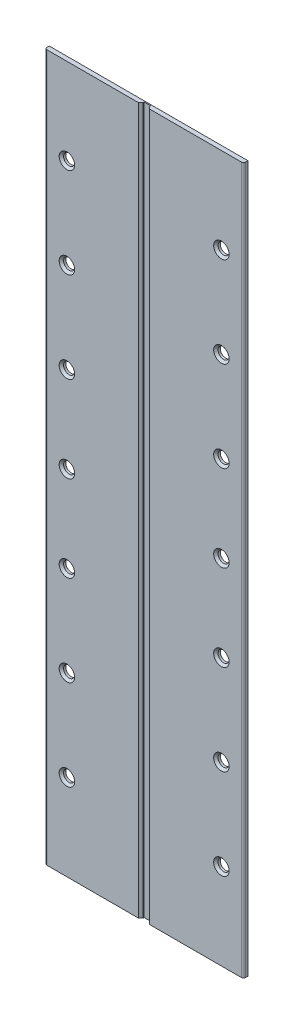
ISO-10303-21;
HEADER;
FILE_DESCRIPTION(('STEP AP214'),'2;1');
FILE_NAME('part.step','',(''),(''),'','','');
FILE_SCHEMA(('AUTOMOTIVE_DESIGN { 1 0 10303 214 1 1 1 1 }'));
ENDSEC;
DATA;
#1=APPLICATION_CONTEXT('core data for automotive mechanical design processes');
#2=APPLICATION_PROTOCOL_DEFINITION('international standard','automotive_design',2000,#1);
#3=PRODUCT_CONTEXT('',#1,'mechanical');
#4=PRODUCT('Part','Part','',(#3));
#5=PRODUCT_RELATED_PRODUCT_CATEGORY('part','',(#4));
#6=PRODUCT_DEFINITION_FORMATION('','',#4);
#7=PRODUCT_DEFINITION_CONTEXT('part definition',#1,'design');
#8=PRODUCT_DEFINITION('design','',#6,#7);
#9=PRODUCT_DEFINITION_SHAPE('','',#8);
#10=(LENGTH_UNIT() NAMED_UNIT(*) SI_UNIT(.MILLI.,.METRE.));
#11=(NAMED_UNIT(*) PLANE_ANGLE_UNIT() SI_UNIT($,.RADIAN.));
#12=(NAMED_UNIT(*) SI_UNIT($,.STERADIAN.) SOLID_ANGLE_UNIT());
#13=UNCERTAINTY_MEASURE_WITH_UNIT(LENGTH_MEASURE(1.E-05),#10,'distance_accuracy_value','');
#14=(GEOMETRIC_REPRESENTATION_CONTEXT(3) GLOBAL_UNCERTAINTY_ASSIGNED_CONTEXT((#13)) GLOBAL_UNIT_ASSIGNED_CONTEXT((#10,
#11,#12)) REPRESENTATION_CONTEXT('',''));
#15=CARTESIAN_POINT('',(0.,0.,0.));
#16=DIRECTION('',(0.,0.,1.));
#17=DIRECTION('',(1.,0.,0.));
#18=AXIS2_PLACEMENT_3D('',#15,#16,#17);
#19=CARTESIAN_POINT('',(0.,0.,2.));
#20=DIRECTION('',(0.,0.,-1.));
#21=DIRECTION('',(-1.,0.,0.));
#22=AXIS2_PLACEMENT_3D('',#19,#20,#21);
#23=PLANE('',#22);
#24=CARTESIAN_POINT('',(-35.,-120.982014682888,2.));
#25=DIRECTION('',(0.,0.,-1.));
#26=DIRECTION('',(-1.,0.,0.));
#27=AXIS2_PLACEMENT_3D('',#24,#25,#26);
#28=CIRCLE('',#27,3.49999999999998);
#29=CARTESIAN_POINT('',(-38.4999999999999,-120.982014682888,2.));
#30=VERTEX_POINT('',#29);
#31=EDGE_CURVE('E251',#30,#30,#28,.T.);
#32=ORIENTED_EDGE('',*,*,#31,.T.);
#33=EDGE_LOOP('',(#32));
#34=FACE_BOUND('',#33,.T.);
#35=CARTESIAN_POINT('',(-35.,-80.,2.));
#36=DIRECTION('',(0.,0.,-1.));
#37=DIRECTION('',(-1.,0.,0.));
#38=AXIS2_PLACEMENT_3D('',#35,#36,#37);
#39=CIRCLE('',#38,3.49999999999998);
#40=CARTESIAN_POINT('',(-38.4999999999999,-80.,2.));
#41=VERTEX_POINT('',#40);
#42=EDGE_CURVE('E254',#41,#41,#39,.T.);
#43=ORIENTED_EDGE('',*,*,#42,.T.);
#44=EDGE_LOOP('',(#43));
#45=FACE_BOUND('',#44,.T.);
#46=CARTESIAN_POINT('',(-35.,-39.0179853171119,2.));
#47=DIRECTION('',(0.,0.,-1.));
#48=DIRECTION('',(-1.,0.,0.));
#49=AXIS2_PLACEMENT_3D('',#46,#47,#48);
#50=CIRCLE('',#49,3.49999999999998);
#51=CARTESIAN_POINT('',(-38.4999999999999,-39.0179853171119,2.));
#52=VERTEX_POINT('',#51);
#53=EDGE_CURVE('E257',#52,#52,#50,.T.);
#54=ORIENTED_EDGE('',*,*,#53,.T.);
#55=EDGE_LOOP('',(#54));
#56=FACE_BOUND('',#55,.T.);
#57=CARTESIAN_POINT('',(-35.,0.,2.));
#58=DIRECTION('',(0.,0.,-1.));
#59=DIRECTION('',(-1.,0.,0.));
#60=AXIS2_PLACEMENT_3D('',#57,#58,#59);
#61=CIRCLE('',#60,3.49999999999998);
#62=CARTESIAN_POINT('',(-38.4999999999999,0.,2.));
#63=VERTEX_POINT('',#62);
#64=EDGE_CURVE('E260',#63,#63,#61,.T.);
#65=ORIENTED_EDGE('',*,*,#64,.T.);
#66=EDGE_LOOP('',(#65));
#67=FACE_BOUND('',#66,.T.);
#68=CARTESIAN_POINT('',(-34.9999999999999,39.0179853171119,2.));
#69=DIRECTION('',(0.,0.,-1.));
#70=DIRECTION('',(-1.,0.,0.));
#71=AXIS2_PLACEMENT_3D('',#68,#69,#70);
#72=CIRCLE('',#71,3.49999999999998);
#73=CARTESIAN_POINT('',(-38.4999999999999,39.0179853171119,2.));
#74=VERTEX_POINT('',#73);
#75=EDGE_CURVE('E263',#74,#74,#72,.T.);
#76=ORIENTED_EDGE('',*,*,#75,.T.);
#77=EDGE_LOOP('',(#76));
#78=FACE_BOUND('',#77,.T.);
#79=CARTESIAN_POINT('',(-35.,80.,2.));
#80=DIRECTION('',(0.,0.,-1.));
#81=DIRECTION('',(-1.,0.,0.));
#82=AXIS2_PLACEMENT_3D('',#79,#80,#81);
#83=CIRCLE('',#82,3.49999999999998);
#84=CARTESIAN_POINT('',(-38.4999999999999,80.,2.));
#85=VERTEX_POINT('',#84);
#86=EDGE_CURVE('E266',#85,#85,#83,.T.);
#87=ORIENTED_EDGE('',*,*,#86,.T.);
#88=EDGE_LOOP('',(#87));
#89=FACE_BOUND('',#88,.T.);
#90=CARTESIAN_POINT('',(-34.9999999999999,120.982014682888,2.));
#91=DIRECTION('',(0.,0.,-1.));
#92=DIRECTION('',(-1.,0.,0.));
#93=AXIS2_PLACEMENT_3D('',#90,#91,#92);
#94=CIRCLE('',#93,3.49999999999998);
#95=CARTESIAN_POINT('',(-38.4999999999999,120.982014682888,2.));
#96=VERTEX_POINT('',#95);
#97=EDGE_CURVE('E269',#96,#96,#94,.T.);
#98=ORIENTED_EDGE('',*,*,#97,.T.);
#99=EDGE_LOOP('',(#98));
#100=FACE_BOUND('',#99,.T.);
#101=DIRECTION('',(1.,0.,0.));
#102=VECTOR('',#101,1.);
#103=CARTESIAN_POINT('',(45.,-160.,2.));
#104=LINE('',#103,#102);
#105=CARTESIAN_POINT('',(-43.9999999999999,-160.,2.));
#106=VERTEX_POINT('',#105);
#107=CARTESIAN_POINT('',(-2.49999999999999,-160.,2.));
#108=VERTEX_POINT('',#107);
#109=EDGE_CURVE('E163',#106,#108,#104,.T.);
#110=ORIENTED_EDGE('',*,*,#109,.T.);
#111=DIRECTION('',(0.,1.,0.));
#112=VECTOR('',#111,1.);
#113=CARTESIAN_POINT('',(-2.5,0.,2.));
#114=LINE('',#113,#112);
#115=CARTESIAN_POINT('',(-2.49999999999999,160.,2.));
#116=VERTEX_POINT('',#115);
#117=EDGE_CURVE('E11',#108,#116,#114,.T.);
#118=ORIENTED_EDGE('',*,*,#117,.T.);
#119=DIRECTION('',(-1.,0.,0.));
#120=VECTOR('',#119,1.);
#121=CARTESIAN_POINT('',(45.,160.,2.));
#122=LINE('',#121,#120);
#123=CARTESIAN_POINT('',(-44.,160.,2.));
#124=VERTEX_POINT('',#123);
#125=EDGE_CURVE('E165',#116,#124,#122,.T.);
#126=ORIENTED_EDGE('',*,*,#125,.T.);
#127=DIRECTION('',(0.,-1.,0.));
#128=VECTOR('',#127,1.);
#129=CARTESIAN_POINT('',(-44.,0.,2.));
#130=LINE('',#129,#128);
#131=EDGE_CURVE('E234',#124,#106,#130,.T.);
#132=ORIENTED_EDGE('',*,*,#131,.T.);
#133=EDGE_LOOP('',(#110,#118,#126,#132));
#134=FACE_BOUND('',#133,.T.);
#135=ADVANCED_FACE('F42',(#34,#45,#56,#67,#78,#89,#100,#134),#23,.F.);
#136=CARTESIAN_POINT('',(34.9999999999999,120.982014682888,2.));
#137=DIRECTION('',(0.,0.,-1.));
#138=DIRECTION('',(-1.,0.,0.));
#139=AXIS2_PLACEMENT_3D('',#136,#137,#138);
#140=CIRCLE('',#139,3.49999999999998);
#141=CARTESIAN_POINT('',(31.5,120.982014682888,2.));
#142=VERTEX_POINT('',#141);
#143=EDGE_CURVE('E290',#142,#142,#140,.T.);
#144=ORIENTED_EDGE('',*,*,#143,.T.);
#145=EDGE_LOOP('',(#144));
#146=FACE_BOUND('',#145,.T.);
#147=CARTESIAN_POINT('',(35.,80.,2.));
#148=DIRECTION('',(0.,0.,-1.));
#149=DIRECTION('',(-1.,0.,0.));
#150=AXIS2_PLACEMENT_3D('',#147,#148,#149);
#151=CIRCLE('',#150,3.49999999999998);
#152=CARTESIAN_POINT('',(31.5,80.,2.));
#153=VERTEX_POINT('',#152);
#154=EDGE_CURVE('E287',#153,#153,#151,.T.);
#155=ORIENTED_EDGE('',*,*,#154,.T.);
#156=EDGE_LOOP('',(#155));
#157=FACE_BOUND('',#156,.T.);
#158=CARTESIAN_POINT('',(34.9999999999999,39.0179853171119,2.));
#159=DIRECTION('',(0.,0.,-1.));
#160=DIRECTION('',(-1.,0.,0.));
#161=AXIS2_PLACEMENT_3D('',#158,#159,#160);
#162=CIRCLE('',#161,3.49999999999998);
#163=CARTESIAN_POINT('',(31.5,39.0179853171119,2.));
#164=VERTEX_POINT('',#163);
#165=EDGE_CURVE('E284',#164,#164,#162,.T.);
#166=ORIENTED_EDGE('',*,*,#165,.T.);
#167=EDGE_LOOP('',(#166));
#168=FACE_BOUND('',#167,.T.);
#169=CARTESIAN_POINT('',(35.,0.,2.));
#170=DIRECTION('',(0.,0.,-1.));
#171=DIRECTION('',(-1.,0.,0.));
#172=AXIS2_PLACEMENT_3D('',#169,#170,#171);
#173=CIRCLE('',#172,3.49999999999998);
#174=CARTESIAN_POINT('',(31.5,0.,2.));
#175=VERTEX_POINT('',#174);
#176=EDGE_CURVE('E281',#175,#175,#173,.T.);
#177=ORIENTED_EDGE('',*,*,#176,.T.);
#178=EDGE_LOOP('',(#177));
#179=FACE_BOUND('',#178,.T.);
#180=CARTESIAN_POINT('',(35.,-39.0179853171119,2.));
#181=DIRECTION('',(0.,0.,-1.));
#182=DIRECTION('',(-1.,0.,0.));
#183=AXIS2_PLACEMENT_3D('',#180,#181,#182);
#184=CIRCLE('',#183,3.49999999999998);
#185=CARTESIAN_POINT('',(31.5,-39.0179853171119,2.));
#186=VERTEX_POINT('',#185);
#187=EDGE_CURVE('E278',#186,#186,#184,.T.);
#188=ORIENTED_EDGE('',*,*,#187,.T.);
#189=EDGE_LOOP('',(#188));
#190=FACE_BOUND('',#189,.T.);
#191=CARTESIAN_POINT('',(35.,-80.,2.));
#192=DIRECTION('',(0.,0.,-1.));
#193=DIRECTION('',(-1.,0.,0.));
#194=AXIS2_PLACEMENT_3D('',#191,#192,#193);
#195=CIRCLE('',#194,3.49999999999998);
#196=CARTESIAN_POINT('',(31.5,-80.,2.));
#197=VERTEX_POINT('',#196);
#198=EDGE_CURVE('E275',#197,#197,#195,.T.);
#199=ORIENTED_EDGE('',*,*,#198,.T.);
#200=EDGE_LOOP('',(#199));
#201=FACE_BOUND('',#200,.T.);
#202=CARTESIAN_POINT('',(35.,-120.982014682888,2.));
#203=DIRECTION('',(0.,0.,-1.));
#204=DIRECTION('',(-1.,0.,0.));
#205=AXIS2_PLACEMENT_3D('',#202,#203,#204);
#206=CIRCLE('',#205,3.49999999999998);
#207=CARTESIAN_POINT('',(31.5,-120.982014682888,2.));
#208=VERTEX_POINT('',#207);
#209=EDGE_CURVE('E272',#208,#208,#206,.T.);
#210=ORIENTED_EDGE('',*,*,#209,.T.);
#211=EDGE_LOOP('',(#210));
#212=FACE_BOUND('',#211,.T.);
#213=CARTESIAN_POINT('',(44.,160.,2.));
#214=VERTEX_POINT('',#213);
#215=CARTESIAN_POINT('',(2.49999999999978,160.,2.));
#216=VERTEX_POINT('',#215);
#217=EDGE_CURVE('E167',#214,#216,#122,.T.);
#218=ORIENTED_EDGE('',*,*,#217,.T.);
#219=DIRECTION('',(0.,-1.,0.));
#220=VECTOR('',#219,1.);
#221=CARTESIAN_POINT('',(2.49999999999988,0.,2.));
#222=LINE('',#221,#220);
#223=CARTESIAN_POINT('',(2.50000000000002,-160.,2.));
#224=VERTEX_POINT('',#223);
#225=EDGE_CURVE('E342',#216,#224,#222,.T.);
#226=ORIENTED_EDGE('',*,*,#225,.T.);
#227=CARTESIAN_POINT('',(44.,-160.,2.));
#228=VERTEX_POINT('',#227);
#229=EDGE_CURVE('E166',#224,#228,#104,.T.);
#230=ORIENTED_EDGE('',*,*,#229,.T.);
#231=DIRECTION('',(0.,1.,0.));
#232=VECTOR('',#231,1.);
#233=CARTESIAN_POINT('',(44.,0.,2.));
#234=LINE('',#233,#232);
#235=EDGE_CURVE('E191',#228,#214,#234,.T.);
#236=ORIENTED_EDGE('',*,*,#235,.T.);
#237=EDGE_LOOP('',(#218,#226,#230,#236));
#238=FACE_BOUND('',#237,.T.);
#239=ADVANCED_FACE('F358',(#146,#157,#168,#179,#190,#201,#212,#238),#23,.F.);
#240=CARTESIAN_POINT('',(0.,0.,0.));
#241=DIRECTION('',(0.,0.,-1.));
#242=DIRECTION('',(-1.,0.,0.));
#243=AXIS2_PLACEMENT_3D('',#240,#241,#242);
#244=PLANE('',#243);
#245=CARTESIAN_POINT('',(-35.,-39.0179853171119,0.));
#246=DIRECTION('',(0.,0.,-1.));
#247=DIRECTION('',(-1.,0.,0.));
#248=AXIS2_PLACEMENT_3D('',#245,#246,#247);
#249=CIRCLE('',#248,2.5);
#250=CARTESIAN_POINT('',(-37.5,-39.0179853171119,0.));
#251=VERTEX_POINT('',#250);
#252=EDGE_CURVE('E175',#251,#251,#249,.T.);
#253=ORIENTED_EDGE('',*,*,#252,.F.);
#254=EDGE_LOOP('',(#253));
#255=FACE_BOUND('',#254,.T.);
#256=CARTESIAN_POINT('',(-34.9999999999999,39.0179853171119,0.));
#257=DIRECTION('',(0.,0.,-1.));
#258=DIRECTION('',(-1.,0.,0.));
#259=AXIS2_PLACEMENT_3D('',#256,#257,#258);
#260=CIRCLE('',#259,2.5);
#261=CARTESIAN_POINT('',(-37.4999999999999,39.0179853171119,0.));
#262=VERTEX_POINT('',#261);
#263=EDGE_CURVE('E218',#262,#262,#260,.F.);
#264=ORIENTED_EDGE('',*,*,#263,.T.);
#265=EDGE_LOOP('',(#264));
#266=FACE_BOUND('',#265,.T.);
#267=CARTESIAN_POINT('',(-35.,80.,0.));
#268=DIRECTION('',(0.,0.,-1.));
#269=DIRECTION('',(-1.,0.,0.));
#270=AXIS2_PLACEMENT_3D('',#267,#268,#269);
#271=CIRCLE('',#270,2.49999999999998);
#272=CARTESIAN_POINT('',(-37.4999999999999,80.,0.));
#273=VERTEX_POINT('',#272);
#274=EDGE_CURVE('E215',#273,#273,#271,.T.);
#275=ORIENTED_EDGE('',*,*,#274,.F.);
#276=EDGE_LOOP('',(#275));
#277=FACE_BOUND('',#276,.T.);
#278=CARTESIAN_POINT('',(35.,80.,0.));
#279=DIRECTION('',(0.,0.,-1.));
#280=DIRECTION('',(-1.,0.,0.));
#281=AXIS2_PLACEMENT_3D('',#278,#279,#280);
#282=CIRCLE('',#281,2.5);
#283=CARTESIAN_POINT('',(32.5,80.,0.));
#284=VERTEX_POINT('',#283);
#285=EDGE_CURVE('E212',#284,#284,#282,.T.);
#286=ORIENTED_EDGE('',*,*,#285,.F.);
#287=EDGE_LOOP('',(#286));
#288=FACE_BOUND('',#287,.T.);
#289=CARTESIAN_POINT('',(-35.,-120.982014682888,0.));
#290=DIRECTION('',(0.,0.,-1.));
#291=DIRECTION('',(-1.,0.,0.));
#292=AXIS2_PLACEMENT_3D('',#289,#290,#291);
#293=CIRCLE('',#292,2.5);
#294=CARTESIAN_POINT('',(-37.5,-120.982014682888,0.));
#295=VERTEX_POINT('',#294);
#296=EDGE_CURVE('E206',#295,#295,#293,.F.);
#297=ORIENTED_EDGE('',*,*,#296,.T.);
#298=EDGE_LOOP('',(#297));
#299=FACE_BOUND('',#298,.T.);
#300=CARTESIAN_POINT('',(-35.,-80.,0.));
#301=DIRECTION('',(0.,0.,-1.));
#302=DIRECTION('',(-1.,0.,0.));
#303=AXIS2_PLACEMENT_3D('',#300,#301,#302);
#304=CIRCLE('',#303,2.5);
#305=CARTESIAN_POINT('',(-37.5,-80.,0.));
#306=VERTEX_POINT('',#305);
#307=EDGE_CURVE('E197',#306,#306,#304,.F.);
#308=ORIENTED_EDGE('',*,*,#307,.T.);
#309=EDGE_LOOP('',(#308));
#310=FACE_BOUND('',#309,.T.);
#311=CARTESIAN_POINT('',(35.,-120.982014682888,0.));
#312=DIRECTION('',(0.,0.,-1.));
#313=DIRECTION('',(-1.,0.,0.));
#314=AXIS2_PLACEMENT_3D('',#311,#312,#313);
#315=CIRCLE('',#314,2.5);
#316=CARTESIAN_POINT('',(32.5,-120.982014682888,0.));
#317=VERTEX_POINT('',#316);
#318=EDGE_CURVE('E194',#317,#317,#315,.T.);
#319=ORIENTED_EDGE('',*,*,#318,.F.);
#320=EDGE_LOOP('',(#319));
#321=FACE_BOUND('',#320,.T.);
#322=CARTESIAN_POINT('',(-34.9999999999999,120.982014682888,0.));
#323=DIRECTION('',(0.,0.,-1.));
#324=DIRECTION('',(-1.,0.,0.));
#325=AXIS2_PLACEMENT_3D('',#322,#323,#324);
#326=CIRCLE('',#325,2.5);
#327=CARTESIAN_POINT('',(-37.4999999999999,120.982014682888,0.));
#328=VERTEX_POINT('',#327);
#329=EDGE_CURVE('E158',#328,#328,#326,.T.);
#330=ORIENTED_EDGE('',*,*,#329,.F.);
#331=EDGE_LOOP('',(#330));
#332=FACE_BOUND('',#331,.T.);
#333=DIRECTION('',(0.,-1.,0.));
#334=VECTOR('',#333,1.);
#335=CARTESIAN_POINT('',(-45.,160.,0.));
#336=LINE('',#335,#334);
#337=CARTESIAN_POINT('',(-45.,160.,0.));
#338=VERTEX_POINT('',#337);
#339=CARTESIAN_POINT('',(-45.,-160.,0.));
#340=VERTEX_POINT('',#339);
#341=EDGE_CURVE('E171',#338,#340,#336,.T.);
#342=ORIENTED_EDGE('',*,*,#341,.F.);
#343=DIRECTION('',(-1.,0.,0.));
#344=VECTOR('',#343,1.);
#345=CARTESIAN_POINT('',(45.,160.,0.));
#346=LINE('',#345,#344);
#347=CARTESIAN_POINT('',(45.,160.,0.));
#348=VERTEX_POINT('',#347);
#349=EDGE_CURVE('E181',#348,#338,#346,.T.);
#350=ORIENTED_EDGE('',*,*,#349,.F.);
#351=DIRECTION('',(0.,1.,0.));
#352=VECTOR('',#351,1.);
#353=CARTESIAN_POINT('',(45.,160.,0.));
#354=LINE('',#353,#352);
#355=CARTESIAN_POINT('',(45.,-160.,0.));
#356=VERTEX_POINT('',#355);
#357=EDGE_CURVE('E178',#356,#348,#354,.T.);
#358=ORIENTED_EDGE('',*,*,#357,.F.);
#359=DIRECTION('',(1.,0.,0.));
#360=VECTOR('',#359,1.);
#361=CARTESIAN_POINT('',(45.,-160.,0.));
#362=LINE('',#361,#360);
#363=EDGE_CURVE('E174',#340,#356,#362,.T.);
#364=ORIENTED_EDGE('',*,*,#363,.F.);
#365=EDGE_LOOP('',(#342,#350,#358,#364));
#366=FACE_BOUND('',#365,.T.);
#367=CARTESIAN_POINT('',(35.,-80.,0.));
#368=DIRECTION('',(0.,0.,-1.));
#369=DIRECTION('',(-1.,0.,0.));
#370=AXIS2_PLACEMENT_3D('',#367,#368,#369);
#371=CIRCLE('',#370,2.5);
#372=CARTESIAN_POINT('',(32.5,-80.,0.));
#373=VERTEX_POINT('',#372);
#374=EDGE_CURVE('E200',#373,#373,#371,.T.);
#375=ORIENTED_EDGE('',*,*,#374,.F.);
#376=EDGE_LOOP('',(#375));
#377=FACE_BOUND('',#376,.T.);
#378=CARTESIAN_POINT('',(35.,-39.0179853171119,0.));
#379=DIRECTION('',(0.,0.,-1.));
#380=DIRECTION('',(-1.,0.,0.));
#381=AXIS2_PLACEMENT_3D('',#378,#379,#380);
#382=CIRCLE('',#381,2.5);
#383=CARTESIAN_POINT('',(32.5,-39.0179853171119,0.));
#384=VERTEX_POINT('',#383);
#385=EDGE_CURVE('E203',#384,#384,#382,.F.);
#386=ORIENTED_EDGE('',*,*,#385,.T.);
#387=EDGE_LOOP('',(#386));
#388=FACE_BOUND('',#387,.T.);
#389=CARTESIAN_POINT('',(34.9999999999999,120.982014682888,0.));
#390=DIRECTION('',(0.,0.,-1.));
#391=DIRECTION('',(-1.,0.,0.));
#392=AXIS2_PLACEMENT_3D('',#389,#390,#391);
#393=CIRCLE('',#392,2.5);
#394=CARTESIAN_POINT('',(32.4999999999999,120.982014682888,0.));
#395=VERTEX_POINT('',#394);
#396=EDGE_CURVE('E209',#395,#395,#393,.F.);
#397=ORIENTED_EDGE('',*,*,#396,.T.);
#398=EDGE_LOOP('',(#397));
#399=FACE_BOUND('',#398,.T.);
#400=CARTESIAN_POINT('',(34.9999999999999,39.0179853171119,0.));
#401=DIRECTION('',(0.,0.,-1.));
#402=DIRECTION('',(-1.,0.,0.));
#403=AXIS2_PLACEMENT_3D('',#400,#401,#402);
#404=CIRCLE('',#403,2.5);
#405=CARTESIAN_POINT('',(32.4999999999999,39.0179853171119,0.));
#406=VERTEX_POINT('',#405);
#407=EDGE_CURVE('E221',#406,#406,#404,.T.);
#408=ORIENTED_EDGE('',*,*,#407,.F.);
#409=EDGE_LOOP('',(#408));
#410=FACE_BOUND('',#409,.T.);
#411=CARTESIAN_POINT('',(35.,0.,0.));
#412=DIRECTION('',(0.,0.,-1.));
#413=DIRECTION('',(-1.,0.,0.));
#414=AXIS2_PLACEMENT_3D('',#411,#412,#413);
#415=CIRCLE('',#414,2.5);
#416=CARTESIAN_POINT('',(32.5,0.,0.));
#417=VERTEX_POINT('',#416);
#418=EDGE_CURVE('E224',#417,#417,#415,.T.);
#419=ORIENTED_EDGE('',*,*,#418,.F.);
#420=EDGE_LOOP('',(#419));
#421=FACE_BOUND('',#420,.T.);
#422=CARTESIAN_POINT('',(-35.,0.,0.));
#423=DIRECTION('',(0.,0.,-1.));
#424=DIRECTION('',(-1.,0.,0.));
#425=AXIS2_PLACEMENT_3D('',#422,#423,#424);
#426=CIRCLE('',#425,2.5);
#427=CARTESIAN_POINT('',(-37.5,0.,0.));
#428=VERTEX_POINT('',#427);
#429=EDGE_CURVE('E227',#428,#428,#426,.F.);
#430=ORIENTED_EDGE('',*,*,#429,.T.);
#431=EDGE_LOOP('',(#430));
#432=FACE_BOUND('',#431,.T.);
#433=ADVANCED_FACE('F373',(#255,#266,#277,#288,#299,#310,#321,#332,#366,#377,#388,#399,#410,
#421,#432),#244,.T.);
#434=CARTESIAN_POINT('',(-45.,160.,2.));
#435=DIRECTION('',(1.,0.,0.));
#436=DIRECTION('',(0.,1.,0.));
#437=AXIS2_PLACEMENT_3D('',#434,#435,#436);
#438=PLANE('',#437);
#439=DIRECTION('',(0.,0.,-1.));
#440=VECTOR('',#439,1.);
#441=CARTESIAN_POINT('',(-45.,-160.,2.));
#442=LINE('',#441,#440);
#443=CARTESIAN_POINT('',(-45.,-160.,1.));
#444=VERTEX_POINT('',#443);
#445=EDGE_CURVE('E189',#444,#340,#442,.T.);
#446=ORIENTED_EDGE('',*,*,#445,.F.);
#447=DIRECTION('',(0.,-1.,0.));
#448=VECTOR('',#447,1.);
#449=CARTESIAN_POINT('',(-45.,160.,1.));
#450=LINE('',#449,#448);
#451=CARTESIAN_POINT('',(-45.,160.,1.));
#452=VERTEX_POINT('',#451);
#453=EDGE_CURVE('E242',#444,#452,#450,.F.);
#454=ORIENTED_EDGE('',*,*,#453,.T.);
#455=DIRECTION('',(0.,0.,-1.));
#456=VECTOR('',#455,1.);
#457=CARTESIAN_POINT('',(-45.,160.,2.));
#458=LINE('',#457,#456);
#459=EDGE_CURVE('E170',#452,#338,#458,.T.);
#460=ORIENTED_EDGE('',*,*,#459,.T.);
#461=ORIENTED_EDGE('',*,*,#341,.T.);
#462=EDGE_LOOP('',(#446,#454,#460,#461));
#463=FACE_BOUND('',#462,.T.);
#464=ADVANCED_FACE('F385',(#463),#438,.F.);
#465=CARTESIAN_POINT('',(45.,-160.,2.));
#466=DIRECTION('',(0.,1.,0.));
#467=DIRECTION('',(0.,0.,1.));
#468=AXIS2_PLACEMENT_3D('',#465,#466,#467);
#469=PLANE('',#468);
#470=ORIENTED_EDGE('',*,*,#229,.F.);
#471=DIRECTION('',(0.707106781186557,0.,0.707106781186538));
#472=VECTOR('',#471,1.);
#473=CARTESIAN_POINT('',(1.49999999999994,-160.,0.999999999999968));
#474=LINE('',#473,#472);
#475=CARTESIAN_POINT('',(1.5,-160.,1.00000000000003));
#476=VERTEX_POINT('',#475);
#477=EDGE_CURVE('E345',#224,#476,#474,.F.);
#478=ORIENTED_EDGE('',*,*,#477,.T.);
#479=DIRECTION('',(0.,0.,1.));
#480=VECTOR('',#479,1.);
#481=CARTESIAN_POINT('',(1.5,-160.,0.5));
#482=LINE('',#481,#480);
#483=CARTESIAN_POINT('',(1.5,-160.,0.5));
#484=VERTEX_POINT('',#483);
#485=EDGE_CURVE('E137',#484,#476,#482,.T.);
#486=ORIENTED_EDGE('',*,*,#485,.F.);
#487=DIRECTION('',(1.,0.,0.));
#488=VECTOR('',#487,1.);
#489=CARTESIAN_POINT('',(0.,-160.,0.5));
#490=LINE('',#489,#488);
#491=CARTESIAN_POINT('',(-1.5,-160.,0.5));
#492=VERTEX_POINT('',#491);
#493=EDGE_CURVE('E143',#492,#484,#490,.T.);
#494=ORIENTED_EDGE('',*,*,#493,.F.);
#495=DIRECTION('',(0.,0.,1.));
#496=VECTOR('',#495,1.);
#497=CARTESIAN_POINT('',(-1.5,-160.,0.5));
#498=LINE('',#497,#496);
#499=CARTESIAN_POINT('',(-1.5,-160.,1.00000000000003));
#500=VERTEX_POINT('',#499);
#501=EDGE_CURVE('E130',#492,#500,#498,.T.);
#502=ORIENTED_EDGE('',*,*,#501,.T.);
#503=DIRECTION('',(0.707106781186557,0.,-0.707106781186538));
#504=VECTOR('',#503,1.);
#505=CARTESIAN_POINT('',(-1.5,-160.,1.00000000000003));
#506=LINE('',#505,#504);
#507=EDGE_CURVE('E58',#500,#108,#506,.F.);
#508=ORIENTED_EDGE('',*,*,#507,.T.);
#509=ORIENTED_EDGE('',*,*,#109,.F.);
#510=CARTESIAN_POINT('',(-44.,-160.,1.));
#511=DIRECTION('',(0.,1.,0.));
#512=DIRECTION('',(0.,0.,1.));
#513=AXIS2_PLACEMENT_3D('',#510,#511,#512);
#514=CIRCLE('',#513,1.);
#515=EDGE_CURVE('E240',#106,#444,#514,.F.);
#516=ORIENTED_EDGE('',*,*,#515,.T.);
#517=ORIENTED_EDGE('',*,*,#445,.T.);
#518=ORIENTED_EDGE('',*,*,#363,.T.);
#519=DIRECTION('',(0.,0.,-1.));
#520=VECTOR('',#519,1.);
#521=CARTESIAN_POINT('',(45.,-160.,2.));
#522=LINE('',#521,#520);
#523=CARTESIAN_POINT('',(45.,-160.,1.));
#524=VERTEX_POINT('',#523);
#525=EDGE_CURVE('E187',#524,#356,#522,.T.);
#526=ORIENTED_EDGE('',*,*,#525,.F.);
#527=CARTESIAN_POINT('',(44.,-160.,1.));
#528=DIRECTION('',(0.,1.,0.));
#529=DIRECTION('',(0.,0.,1.));
#530=AXIS2_PLACEMENT_3D('',#527,#528,#529);
#531=CIRCLE('',#530,1.);
#532=EDGE_CURVE('E237',#524,#228,#531,.F.);
#533=ORIENTED_EDGE('',*,*,#532,.T.);
#534=EDGE_LOOP('',(#470,#478,#486,#494,#502,#508,#509,#516,#517,#518,#526,#533));
#535=FACE_BOUND('',#534,.T.);
#536=ADVANCED_FACE('F149',(#535),#469,.F.);
#537=CARTESIAN_POINT('',(45.,160.,2.));
#538=DIRECTION('',(-1.,0.,0.));
#539=DIRECTION('',(0.,-1.,0.));
#540=AXIS2_PLACEMENT_3D('',#537,#538,#539);
#541=PLANE('',#540);
#542=DIRECTION('',(0.,0.,-1.));
#543=VECTOR('',#542,1.);
#544=CARTESIAN_POINT('',(45.,160.,2.));
#545=LINE('',#544,#543);
#546=CARTESIAN_POINT('',(45.,160.,1.));
#547=VERTEX_POINT('',#546);
#548=EDGE_CURVE('E185',#547,#348,#545,.T.);
#549=ORIENTED_EDGE('',*,*,#548,.F.);
#550=DIRECTION('',(0.,1.,0.));
#551=VECTOR('',#550,1.);
#552=CARTESIAN_POINT('',(45.,160.,1.));
#553=LINE('',#552,#551);
#554=EDGE_CURVE('E249',#547,#524,#553,.F.);
#555=ORIENTED_EDGE('',*,*,#554,.T.);
#556=ORIENTED_EDGE('',*,*,#525,.T.);
#557=ORIENTED_EDGE('',*,*,#357,.T.);
#558=EDGE_LOOP('',(#549,#555,#556,#557));
#559=FACE_BOUND('',#558,.T.);
#560=ADVANCED_FACE('F366',(#559),#541,.F.);
#561=CARTESIAN_POINT('',(45.,160.,2.));
#562=DIRECTION('',(0.,-1.,0.));
#563=DIRECTION('',(1.,0.,0.));
#564=AXIS2_PLACEMENT_3D('',#561,#562,#563);
#565=PLANE('',#564);
#566=DIRECTION('',(0.,0.,1.));
#567=VECTOR('',#566,1.);
#568=CARTESIAN_POINT('',(1.49999999999976,160.,0.5));
#569=LINE('',#568,#567);
#570=CARTESIAN_POINT('',(1.5,160.,0.5));
#571=VERTEX_POINT('',#570);
#572=CARTESIAN_POINT('',(1.49999999999976,160.,1.00000000000003));
#573=VERTEX_POINT('',#572);
#574=EDGE_CURVE('E159',#571,#573,#569,.T.);
#575=ORIENTED_EDGE('',*,*,#574,.T.);
#576=DIRECTION('',(-0.707106781186557,0.,-0.707106781186538));
#577=VECTOR('',#576,1.);
#578=CARTESIAN_POINT('',(1.4999999999998,160.,1.00000000000006));
#579=LINE('',#578,#577);
#580=EDGE_CURVE('E340',#573,#216,#579,.F.);
#581=ORIENTED_EDGE('',*,*,#580,.T.);
#582=ORIENTED_EDGE('',*,*,#217,.F.);
#583=CARTESIAN_POINT('',(44.,160.,1.));
#584=DIRECTION('',(0.,-1.,0.));
#585=DIRECTION('',(1.,0.,0.));
#586=AXIS2_PLACEMENT_3D('',#583,#584,#585);
#587=CIRCLE('',#586,1.);
#588=EDGE_CURVE('E244',#214,#547,#587,.F.);
#589=ORIENTED_EDGE('',*,*,#588,.T.);
#590=ORIENTED_EDGE('',*,*,#548,.T.);
#591=ORIENTED_EDGE('',*,*,#349,.T.);
#592=ORIENTED_EDGE('',*,*,#459,.F.);
#593=CARTESIAN_POINT('',(-44.,160.,1.));
#594=DIRECTION('',(0.,-1.,0.));
#595=DIRECTION('',(1.,0.,0.));
#596=AXIS2_PLACEMENT_3D('',#593,#594,#595);
#597=CIRCLE('',#596,1.);
#598=EDGE_CURVE('E246',#452,#124,#597,.F.);
#599=ORIENTED_EDGE('',*,*,#598,.T.);
#600=ORIENTED_EDGE('',*,*,#125,.F.);
#601=DIRECTION('',(-0.707106781186557,0.,0.707106781186538));
#602=VECTOR('',#601,1.);
#603=CARTESIAN_POINT('',(-1.50000000000002,160.,1.00000000000005));
#604=LINE('',#603,#602);
#605=CARTESIAN_POINT('',(-1.5,160.,1.00000000000003));
#606=VERTEX_POINT('',#605);
#607=EDGE_CURVE('E338',#116,#606,#604,.F.);
#608=ORIENTED_EDGE('',*,*,#607,.T.);
#609=DIRECTION('',(0.,0.,1.));
#610=VECTOR('',#609,1.);
#611=CARTESIAN_POINT('',(-1.5,160.,0.5));
#612=LINE('',#611,#610);
#613=CARTESIAN_POINT('',(-1.5,160.,0.5));
#614=VERTEX_POINT('',#613);
#615=EDGE_CURVE('E156',#614,#606,#612,.T.);
#616=ORIENTED_EDGE('',*,*,#615,.F.);
#617=DIRECTION('',(-1.,0.,0.));
#618=VECTOR('',#617,1.);
#619=CARTESIAN_POINT('',(0.,160.,0.5));
#620=LINE('',#619,#618);
#621=EDGE_CURVE('E138',#571,#614,#620,.T.);
#622=ORIENTED_EDGE('',*,*,#621,.F.);
#623=EDGE_LOOP('',(#575,#581,#582,#589,#590,#591,#592,#599,#600,#608,#616,#622));
#624=FACE_BOUND('',#623,.T.);
#625=ADVANCED_FACE('F356',(#624),#565,.F.);
#626=CARTESIAN_POINT('',(-34.9999999999999,120.982014682888,-43.));
#627=DIRECTION('',(0.,0.,1.));
#628=DIRECTION('',(1.,0.,0.));
#629=AXIS2_PLACEMENT_3D('',#626,#627,#628);
#630=CYLINDRICAL_SURFACE('',#629,2.5);
#631=CARTESIAN_POINT('',(-34.9999999999999,120.982014682888,1.));
#632=DIRECTION('',(0.,0.,-1.));
#633=DIRECTION('',(-1.,0.,0.));
#634=AXIS2_PLACEMENT_3D('',#631,#632,#633);
#635=CIRCLE('',#634,2.5);
#636=CARTESIAN_POINT('',(-37.4999999999999,120.982014682888,1.));
#637=VERTEX_POINT('',#636);
#638=EDGE_CURVE('E314',#637,#637,#635,.F.);
#639=ORIENTED_EDGE('',*,*,#638,.T.);
#640=EDGE_LOOP('',(#639));
#641=FACE_BOUND('',#640,.T.);
#642=ORIENTED_EDGE('',*,*,#329,.T.);
#643=EDGE_LOOP('',(#642));
#644=FACE_BOUND('',#643,.T.);
#645=ADVANCED_FACE('F407',(#641,#644),#630,.F.);
#646=CARTESIAN_POINT('',(35.,-120.982014682888,-43.));
#647=DIRECTION('',(0.,0.,1.));
#648=DIRECTION('',(1.,0.,0.));
#649=AXIS2_PLACEMENT_3D('',#646,#647,#648);
#650=CYLINDRICAL_SURFACE('',#649,2.5);
#651=CARTESIAN_POINT('',(35.,-120.982014682888,1.));
#652=DIRECTION('',(0.,0.,-1.));
#653=DIRECTION('',(-1.,0.,0.));
#654=AXIS2_PLACEMENT_3D('',#651,#652,#653);
#655=CIRCLE('',#654,2.5);
#656=CARTESIAN_POINT('',(32.5,-120.982014682888,1.));
#657=VERTEX_POINT('',#656);
#658=EDGE_CURVE('E311',#657,#657,#655,.F.);
#659=ORIENTED_EDGE('',*,*,#658,.T.);
#660=EDGE_LOOP('',(#659));
#661=FACE_BOUND('',#660,.T.);
#662=ORIENTED_EDGE('',*,*,#318,.T.);
#663=EDGE_LOOP('',(#662));
#664=FACE_BOUND('',#663,.T.);
#665=ADVANCED_FACE('F433',(#661,#664),#650,.F.);
#666=CARTESIAN_POINT('',(-35.,-80.,-43.));
#667=DIRECTION('',(0.,0.,1.));
#668=DIRECTION('',(1.,0.,0.));
#669=AXIS2_PLACEMENT_3D('',#666,#667,#668);
#670=CYLINDRICAL_SURFACE('',#669,2.5);
#671=CARTESIAN_POINT('',(-35.,-80.,1.));
#672=DIRECTION('',(0.,0.,-1.));
#673=DIRECTION('',(-1.,0.,0.));
#674=AXIS2_PLACEMENT_3D('',#671,#672,#673);
#675=CIRCLE('',#674,2.5);
#676=CARTESIAN_POINT('',(-37.5,-80.,1.));
#677=VERTEX_POINT('',#676);
#678=EDGE_CURVE('E329',#677,#677,#675,.F.);
#679=ORIENTED_EDGE('',*,*,#678,.T.);
#680=EDGE_LOOP('',(#679));
#681=FACE_BOUND('',#680,.T.);
#682=ORIENTED_EDGE('',*,*,#307,.F.);
#683=EDGE_LOOP('',(#682));
#684=FACE_BOUND('',#683,.T.);
#685=ADVANCED_FACE('F441',(#681,#684),#670,.F.);
#686=CARTESIAN_POINT('',(35.,-80.,-43.));
#687=DIRECTION('',(0.,0.,1.));
#688=DIRECTION('',(1.,0.,0.));
#689=AXIS2_PLACEMENT_3D('',#686,#687,#688);
#690=CYLINDRICAL_SURFACE('',#689,2.5);
#691=CARTESIAN_POINT('',(35.,-80.,1.));
#692=DIRECTION('',(0.,0.,-1.));
#693=DIRECTION('',(-1.,0.,0.));
#694=AXIS2_PLACEMENT_3D('',#691,#692,#693);
#695=CIRCLE('',#694,2.5);
#696=CARTESIAN_POINT('',(32.5,-80.,1.));
#697=VERTEX_POINT('',#696);
#698=EDGE_CURVE('E308',#697,#697,#695,.F.);
#699=ORIENTED_EDGE('',*,*,#698,.T.);
#700=EDGE_LOOP('',(#699));
#701=FACE_BOUND('',#700,.T.);
#702=ORIENTED_EDGE('',*,*,#374,.T.);
#703=EDGE_LOOP('',(#702));
#704=FACE_BOUND('',#703,.T.);
#705=ADVANCED_FACE('F449',(#701,#704),#690,.F.);
#706=CARTESIAN_POINT('',(35.,-39.0179853171119,-43.));
#707=DIRECTION('',(0.,0.,1.));
#708=DIRECTION('',(1.,0.,0.));
#709=AXIS2_PLACEMENT_3D('',#706,#707,#708);
#710=CYLINDRICAL_SURFACE('',#709,2.5);
#711=CARTESIAN_POINT('',(35.,-39.0179853171119,1.));
#712=DIRECTION('',(0.,0.,-1.));
#713=DIRECTION('',(-1.,0.,0.));
#714=AXIS2_PLACEMENT_3D('',#711,#712,#713);
#715=CIRCLE('',#714,2.5);
#716=CARTESIAN_POINT('',(32.5,-39.0179853171119,1.));
#717=VERTEX_POINT('',#716);
#718=EDGE_CURVE('E305',#717,#717,#715,.F.);
#719=ORIENTED_EDGE('',*,*,#718,.T.);
#720=EDGE_LOOP('',(#719));
#721=FACE_BOUND('',#720,.T.);
#722=ORIENTED_EDGE('',*,*,#385,.F.);
#723=EDGE_LOOP('',(#722));
#724=FACE_BOUND('',#723,.T.);
#725=ADVANCED_FACE('F457',(#721,#724),#710,.F.);
#726=CARTESIAN_POINT('',(-35.,-120.982014682888,-43.));
#727=DIRECTION('',(0.,0.,1.));
#728=DIRECTION('',(1.,0.,0.));
#729=AXIS2_PLACEMENT_3D('',#726,#727,#728);
#730=CYLINDRICAL_SURFACE('',#729,2.5);
#731=CARTESIAN_POINT('',(-35.,-120.982014682888,1.));
#732=DIRECTION('',(0.,0.,-1.));
#733=DIRECTION('',(-1.,0.,0.));
#734=AXIS2_PLACEMENT_3D('',#731,#732,#733);
#735=CIRCLE('',#734,2.5);
#736=CARTESIAN_POINT('',(-37.5,-120.982014682888,1.));
#737=VERTEX_POINT('',#736);
#738=EDGE_CURVE('E332',#737,#737,#735,.F.);
#739=ORIENTED_EDGE('',*,*,#738,.T.);
#740=EDGE_LOOP('',(#739));
#741=FACE_BOUND('',#740,.T.);
#742=ORIENTED_EDGE('',*,*,#296,.F.);
#743=EDGE_LOOP('',(#742));
#744=FACE_BOUND('',#743,.T.);
#745=ADVANCED_FACE('F465',(#741,#744),#730,.F.);
#746=CARTESIAN_POINT('',(34.9999999999999,120.982014682888,-43.));
#747=DIRECTION('',(0.,0.,1.));
#748=DIRECTION('',(1.,0.,0.));
#749=AXIS2_PLACEMENT_3D('',#746,#747,#748);
#750=CYLINDRICAL_SURFACE('',#749,2.5);
#751=CARTESIAN_POINT('',(34.9999999999999,120.982014682888,1.));
#752=DIRECTION('',(0.,0.,-1.));
#753=DIRECTION('',(-1.,0.,0.));
#754=AXIS2_PLACEMENT_3D('',#751,#752,#753);
#755=CIRCLE('',#754,2.5);
#756=CARTESIAN_POINT('',(32.4999999999999,120.982014682888,1.));
#757=VERTEX_POINT('',#756);
#758=EDGE_CURVE('E293',#757,#757,#755,.F.);
#759=ORIENTED_EDGE('',*,*,#758,.T.);
#760=EDGE_LOOP('',(#759));
#761=FACE_BOUND('',#760,.T.);
#762=ORIENTED_EDGE('',*,*,#396,.F.);
#763=EDGE_LOOP('',(#762));
#764=FACE_BOUND('',#763,.T.);
#765=ADVANCED_FACE('F473',(#761,#764),#750,.F.);
#766=CARTESIAN_POINT('',(35.,80.,-43.));
#767=DIRECTION('',(0.,0.,1.));
#768=DIRECTION('',(1.,0.,0.));
#769=AXIS2_PLACEMENT_3D('',#766,#767,#768);
#770=CYLINDRICAL_SURFACE('',#769,2.5);
#771=CARTESIAN_POINT('',(35.,80.,1.));
#772=DIRECTION('',(0.,0.,-1.));
#773=DIRECTION('',(-1.,0.,0.));
#774=AXIS2_PLACEMENT_3D('',#771,#772,#773);
#775=CIRCLE('',#774,2.5);
#776=CARTESIAN_POINT('',(32.5,80.,1.));
#777=VERTEX_POINT('',#776);
#778=EDGE_CURVE('E296',#777,#777,#775,.F.);
#779=ORIENTED_EDGE('',*,*,#778,.T.);
#780=EDGE_LOOP('',(#779));
#781=FACE_BOUND('',#780,.T.);
#782=ORIENTED_EDGE('',*,*,#285,.T.);
#783=EDGE_LOOP('',(#782));
#784=FACE_BOUND('',#783,.T.);
#785=ADVANCED_FACE('F481',(#781,#784),#770,.F.);
#786=CARTESIAN_POINT('',(-35.,80.,-43.));
#787=DIRECTION('',(0.,0.,1.));
#788=DIRECTION('',(1.,0.,0.));
#789=AXIS2_PLACEMENT_3D('',#786,#787,#788);
#790=CYLINDRICAL_SURFACE('',#789,2.49999999999998);
#791=CARTESIAN_POINT('',(-35.,80.,0.999999999999973));
#792=DIRECTION('',(0.,0.,-1.));
#793=DIRECTION('',(-1.,0.,0.));
#794=AXIS2_PLACEMENT_3D('',#791,#792,#793);
#795=CIRCLE('',#794,2.49999999999998);
#796=CARTESIAN_POINT('',(-37.4999999999999,80.,0.999999999999973));
#797=VERTEX_POINT('',#796);
#798=EDGE_CURVE('E317',#797,#797,#795,.F.);
#799=ORIENTED_EDGE('',*,*,#798,.T.);
#800=EDGE_LOOP('',(#799));
#801=FACE_BOUND('',#800,.T.);
#802=ORIENTED_EDGE('',*,*,#274,.T.);
#803=EDGE_LOOP('',(#802));
#804=FACE_BOUND('',#803,.T.);
#805=ADVANCED_FACE('F489',(#801,#804),#790,.F.);
#806=CARTESIAN_POINT('',(-34.9999999999999,39.0179853171119,-43.));
#807=DIRECTION('',(0.,0.,1.));
#808=DIRECTION('',(1.,0.,0.));
#809=AXIS2_PLACEMENT_3D('',#806,#807,#808);
#810=CYLINDRICAL_SURFACE('',#809,2.5);
#811=CARTESIAN_POINT('',(-34.9999999999999,39.0179853171119,1.));
#812=DIRECTION('',(0.,0.,-1.));
#813=DIRECTION('',(-1.,0.,0.));
#814=AXIS2_PLACEMENT_3D('',#811,#812,#813);
#815=CIRCLE('',#814,2.5);
#816=CARTESIAN_POINT('',(-37.4999999999999,39.0179853171119,1.));
#817=VERTEX_POINT('',#816);
#818=EDGE_CURVE('E320',#817,#817,#815,.F.);
#819=ORIENTED_EDGE('',*,*,#818,.T.);
#820=EDGE_LOOP('',(#819));
#821=FACE_BOUND('',#820,.T.);
#822=ORIENTED_EDGE('',*,*,#263,.F.);
#823=EDGE_LOOP('',(#822));
#824=FACE_BOUND('',#823,.T.);
#825=ADVANCED_FACE('F497',(#821,#824),#810,.F.);
#826=CARTESIAN_POINT('',(34.9999999999999,39.0179853171119,-43.));
#827=DIRECTION('',(0.,0.,1.));
#828=DIRECTION('',(1.,0.,0.));
#829=AXIS2_PLACEMENT_3D('',#826,#827,#828);
#830=CYLINDRICAL_SURFACE('',#829,2.5);
#831=CARTESIAN_POINT('',(34.9999999999999,39.0179853171119,1.));
#832=DIRECTION('',(0.,0.,-1.));
#833=DIRECTION('',(-1.,0.,0.));
#834=AXIS2_PLACEMENT_3D('',#831,#832,#833);
#835=CIRCLE('',#834,2.5);
#836=CARTESIAN_POINT('',(32.4999999999999,39.0179853171119,1.));
#837=VERTEX_POINT('',#836);
#838=EDGE_CURVE('E299',#837,#837,#835,.F.);
#839=ORIENTED_EDGE('',*,*,#838,.T.);
#840=EDGE_LOOP('',(#839));
#841=FACE_BOUND('',#840,.T.);
#842=ORIENTED_EDGE('',*,*,#407,.T.);
#843=EDGE_LOOP('',(#842));
#844=FACE_BOUND('',#843,.T.);
#845=ADVANCED_FACE('F505',(#841,#844),#830,.F.);
#846=CARTESIAN_POINT('',(35.,0.,-43.));
#847=DIRECTION('',(0.,0.,1.));
#848=DIRECTION('',(1.,0.,0.));
#849=AXIS2_PLACEMENT_3D('',#846,#847,#848);
#850=CYLINDRICAL_SURFACE('',#849,2.5);
#851=CARTESIAN_POINT('',(35.,0.,1.));
#852=DIRECTION('',(0.,0.,-1.));
#853=DIRECTION('',(-1.,0.,0.));
#854=AXIS2_PLACEMENT_3D('',#851,#852,#853);
#855=CIRCLE('',#854,2.5);
#856=CARTESIAN_POINT('',(32.5,0.,1.));
#857=VERTEX_POINT('',#856);
#858=EDGE_CURVE('E302',#857,#857,#855,.F.);
#859=ORIENTED_EDGE('',*,*,#858,.T.);
#860=EDGE_LOOP('',(#859));
#861=FACE_BOUND('',#860,.T.);
#862=ORIENTED_EDGE('',*,*,#418,.T.);
#863=EDGE_LOOP('',(#862));
#864=FACE_BOUND('',#863,.T.);
#865=ADVANCED_FACE('F512',(#861,#864),#850,.F.);
#866=CARTESIAN_POINT('',(-35.,0.,-43.));
#867=DIRECTION('',(0.,0.,1.));
#868=DIRECTION('',(1.,0.,0.));
#869=AXIS2_PLACEMENT_3D('',#866,#867,#868);
#870=CYLINDRICAL_SURFACE('',#869,2.5);
#871=CARTESIAN_POINT('',(-35.,0.,1.));
#872=DIRECTION('',(0.,0.,-1.));
#873=DIRECTION('',(-1.,0.,0.));
#874=AXIS2_PLACEMENT_3D('',#871,#872,#873);
#875=CIRCLE('',#874,2.5);
#876=CARTESIAN_POINT('',(-37.5,0.,1.));
#877=VERTEX_POINT('',#876);
#878=EDGE_CURVE('E323',#877,#877,#875,.F.);
#879=ORIENTED_EDGE('',*,*,#878,.T.);
#880=EDGE_LOOP('',(#879));
#881=FACE_BOUND('',#880,.T.);
#882=ORIENTED_EDGE('',*,*,#429,.F.);
#883=EDGE_LOOP('',(#882));
#884=FACE_BOUND('',#883,.T.);
#885=ADVANCED_FACE('F520',(#881,#884),#870,.F.);
#886=CARTESIAN_POINT('',(-35.,-39.0179853171119,-43.));
#887=DIRECTION('',(0.,0.,1.));
#888=DIRECTION('',(1.,0.,0.));
#889=AXIS2_PLACEMENT_3D('',#886,#887,#888);
#890=CYLINDRICAL_SURFACE('',#889,2.5);
#891=CARTESIAN_POINT('',(-35.,-39.0179853171119,1.));
#892=DIRECTION('',(0.,0.,-1.));
#893=DIRECTION('',(-1.,0.,0.));
#894=AXIS2_PLACEMENT_3D('',#891,#892,#893);
#895=CIRCLE('',#894,2.5);
#896=CARTESIAN_POINT('',(-37.5,-39.0179853171119,1.));
#897=VERTEX_POINT('',#896);
#898=EDGE_CURVE('E326',#897,#897,#895,.F.);
#899=ORIENTED_EDGE('',*,*,#898,.T.);
#900=EDGE_LOOP('',(#899));
#901=FACE_BOUND('',#900,.T.);
#902=ORIENTED_EDGE('',*,*,#252,.T.);
#903=EDGE_LOOP('',(#902));
#904=FACE_BOUND('',#903,.T.);
#905=ADVANCED_FACE('F528',(#901,#904),#890,.F.);
#906=CARTESIAN_POINT('',(-44.,0.,1.));
#907=DIRECTION('',(0.,-1.,0.));
#908=DIRECTION('',(1.,0.,0.));
#909=AXIS2_PLACEMENT_3D('',#906,#907,#908);
#910=CYLINDRICAL_SURFACE('',#909,1.);
#911=ORIENTED_EDGE('',*,*,#598,.F.);
#912=ORIENTED_EDGE('',*,*,#453,.F.);
#913=ORIENTED_EDGE('',*,*,#515,.F.);
#914=ORIENTED_EDGE('',*,*,#131,.F.);
#915=EDGE_LOOP('',(#911,#912,#913,#914));
#916=FACE_BOUND('',#915,.T.);
#917=ADVANCED_FACE('F382',(#916),#910,.T.);
#918=CARTESIAN_POINT('',(44.,0.,1.));
#919=DIRECTION('',(0.,1.,0.));
#920=DIRECTION('',(-1.,0.,0.));
#921=AXIS2_PLACEMENT_3D('',#918,#919,#920);
#922=CYLINDRICAL_SURFACE('',#921,1.);
#923=ORIENTED_EDGE('',*,*,#532,.F.);
#924=ORIENTED_EDGE('',*,*,#554,.F.);
#925=ORIENTED_EDGE('',*,*,#588,.F.);
#926=ORIENTED_EDGE('',*,*,#235,.F.);
#927=EDGE_LOOP('',(#923,#924,#925,#926));
#928=FACE_BOUND('',#927,.T.);
#929=ADVANCED_FACE('F362',(#928),#922,.T.);
#930=CARTESIAN_POINT('',(34.9999999999999,120.982014682888,2.));
#931=DIRECTION('',(0.,0.,1.));
#932=DIRECTION('',(1.,0.,0.));
#933=AXIS2_PLACEMENT_3D('',#930,#931,#932);
#934=CONICAL_SURFACE('',#933,3.49999999999998,0.785398163397434);
#935=ORIENTED_EDGE('',*,*,#758,.F.);
#936=EDGE_LOOP('',(#935));
#937=FACE_BOUND('',#936,.T.);
#938=ORIENTED_EDGE('',*,*,#143,.F.);
#939=EDGE_LOOP('',(#938));
#940=FACE_BOUND('',#939,.T.);
#941=ADVANCED_FACE('F547',(#937,#940),#934,.F.);
#942=CARTESIAN_POINT('',(35.,80.,1.));
#943=DIRECTION('',(0.,0.,1.));
#944=DIRECTION('',(1.,0.,0.));
#945=AXIS2_PLACEMENT_3D('',#942,#943,#944);
#946=CONICAL_SURFACE('',#945,2.5,0.785398163397434);
#947=ORIENTED_EDGE('',*,*,#154,.F.);
#948=EDGE_LOOP('',(#947));
#949=FACE_BOUND('',#948,.T.);
#950=ORIENTED_EDGE('',*,*,#778,.F.);
#951=EDGE_LOOP('',(#950));
#952=FACE_BOUND('',#951,.T.);
#953=ADVANCED_FACE('F553',(#949,#952),#946,.F.);
#954=CARTESIAN_POINT('',(34.9999999999999,39.0179853171119,1.));
#955=DIRECTION('',(0.,0.,1.));
#956=DIRECTION('',(1.,0.,0.));
#957=AXIS2_PLACEMENT_3D('',#954,#955,#956);
#958=CONICAL_SURFACE('',#957,2.5,0.785398163397434);
#959=ORIENTED_EDGE('',*,*,#165,.F.);
#960=EDGE_LOOP('',(#959));
#961=FACE_BOUND('',#960,.T.);
#962=ORIENTED_EDGE('',*,*,#838,.F.);
#963=EDGE_LOOP('',(#962));
#964=FACE_BOUND('',#963,.T.);
#965=ADVANCED_FACE('F561',(#961,#964),#958,.F.);
#966=CARTESIAN_POINT('',(35.,0.,1.));
#967=DIRECTION('',(0.,0.,1.));
#968=DIRECTION('',(1.,0.,0.));
#969=AXIS2_PLACEMENT_3D('',#966,#967,#968);
#970=CONICAL_SURFACE('',#969,2.5,0.785398163397435);
#971=ORIENTED_EDGE('',*,*,#176,.F.);
#972=EDGE_LOOP('',(#971));
#973=FACE_BOUND('',#972,.T.);
#974=ORIENTED_EDGE('',*,*,#858,.F.);
#975=EDGE_LOOP('',(#974));
#976=FACE_BOUND('',#975,.T.);
#977=ADVANCED_FACE('F569',(#973,#976),#970,.F.);
#978=CARTESIAN_POINT('',(35.,-39.0179853171119,2.));
#979=DIRECTION('',(0.,0.,1.));
#980=DIRECTION('',(1.,0.,0.));
#981=AXIS2_PLACEMENT_3D('',#978,#979,#980);
#982=CONICAL_SURFACE('',#981,3.49999999999998,0.785398163397434);
#983=ORIENTED_EDGE('',*,*,#718,.F.);
#984=EDGE_LOOP('',(#983));
#985=FACE_BOUND('',#984,.T.);
#986=ORIENTED_EDGE('',*,*,#187,.F.);
#987=EDGE_LOOP('',(#986));
#988=FACE_BOUND('',#987,.T.);
#989=ADVANCED_FACE('F577',(#985,#988),#982,.F.);
#990=CARTESIAN_POINT('',(35.,-80.,1.));
#991=DIRECTION('',(0.,0.,1.));
#992=DIRECTION('',(1.,0.,0.));
#993=AXIS2_PLACEMENT_3D('',#990,#991,#992);
#994=CONICAL_SURFACE('',#993,2.5,0.785398163397434);
#995=ORIENTED_EDGE('',*,*,#198,.F.);
#996=EDGE_LOOP('',(#995));
#997=FACE_BOUND('',#996,.T.);
#998=ORIENTED_EDGE('',*,*,#698,.F.);
#999=EDGE_LOOP('',(#998));
#1000=FACE_BOUND('',#999,.T.);
#1001=ADVANCED_FACE('F585',(#997,#1000),#994,.F.);
#1002=CARTESIAN_POINT('',(35.,-120.982014682888,1.));
#1003=DIRECTION('',(0.,0.,1.));
#1004=DIRECTION('',(1.,0.,0.));
#1005=AXIS2_PLACEMENT_3D('',#1002,#1003,#1004);
#1006=CONICAL_SURFACE('',#1005,2.5,0.785398163397434);
#1007=ORIENTED_EDGE('',*,*,#209,.F.);
#1008=EDGE_LOOP('',(#1007));
#1009=FACE_BOUND('',#1008,.T.);
#1010=ORIENTED_EDGE('',*,*,#658,.F.);
#1011=EDGE_LOOP('',(#1010));
#1012=FACE_BOUND('',#1011,.T.);
#1013=ADVANCED_FACE('F593',(#1009,#1012),#1006,.F.);
#1014=CARTESIAN_POINT('',(-34.9999999999999,120.982014682888,1.));
#1015=DIRECTION('',(0.,0.,1.));
#1016=DIRECTION('',(1.,0.,0.));
#1017=AXIS2_PLACEMENT_3D('',#1014,#1015,#1016);
#1018=CONICAL_SURFACE('',#1017,2.5,0.785398163397434);
#1019=ORIENTED_EDGE('',*,*,#97,.F.);
#1020=EDGE_LOOP('',(#1019));
#1021=FACE_BOUND('',#1020,.T.);
#1022=ORIENTED_EDGE('',*,*,#638,.F.);
#1023=EDGE_LOOP('',(#1022));
#1024=FACE_BOUND('',#1023,.T.);
#1025=ADVANCED_FACE('F601',(#1021,#1024),#1018,.F.);
#1026=CARTESIAN_POINT('',(-35.,80.,0.999999999999973));
#1027=DIRECTION('',(0.,0.,1.));
#1028=DIRECTION('',(1.,0.,0.));
#1029=AXIS2_PLACEMENT_3D('',#1026,#1027,#1028);
#1030=CONICAL_SURFACE('',#1029,2.49999999999998,0.785398163397434);
#1031=ORIENTED_EDGE('',*,*,#86,.F.);
#1032=EDGE_LOOP('',(#1031));
#1033=FACE_BOUND('',#1032,.T.);
#1034=ORIENTED_EDGE('',*,*,#798,.F.);
#1035=EDGE_LOOP('',(#1034));
#1036=FACE_BOUND('',#1035,.T.);
#1037=ADVANCED_FACE('F609',(#1033,#1036),#1030,.F.);
#1038=CARTESIAN_POINT('',(-34.9999999999999,39.0179853171119,2.));
#1039=DIRECTION('',(0.,0.,1.));
#1040=DIRECTION('',(1.,0.,0.));
#1041=AXIS2_PLACEMENT_3D('',#1038,#1039,#1040);
#1042=CONICAL_SURFACE('',#1041,3.49999999999998,0.785398163397434);
#1043=ORIENTED_EDGE('',*,*,#818,.F.);
#1044=EDGE_LOOP('',(#1043));
#1045=FACE_BOUND('',#1044,.T.);
#1046=ORIENTED_EDGE('',*,*,#75,.F.);
#1047=EDGE_LOOP('',(#1046));
#1048=FACE_BOUND('',#1047,.T.);
#1049=ADVANCED_FACE('F617',(#1045,#1048),#1042,.F.);
#1050=CARTESIAN_POINT('',(-35.,0.,2.));
#1051=DIRECTION('',(0.,0.,1.));
#1052=DIRECTION('',(1.,0.,0.));
#1053=AXIS2_PLACEMENT_3D('',#1050,#1051,#1052);
#1054=CONICAL_SURFACE('',#1053,3.49999999999998,0.785398163397435);
#1055=ORIENTED_EDGE('',*,*,#878,.F.);
#1056=EDGE_LOOP('',(#1055));
#1057=FACE_BOUND('',#1056,.T.);
#1058=ORIENTED_EDGE('',*,*,#64,.F.);
#1059=EDGE_LOOP('',(#1058));
#1060=FACE_BOUND('',#1059,.T.);
#1061=ADVANCED_FACE('F625',(#1057,#1060),#1054,.F.);
#1062=CARTESIAN_POINT('',(-35.,-39.0179853171119,1.));
#1063=DIRECTION('',(0.,0.,1.));
#1064=DIRECTION('',(1.,0.,0.));
#1065=AXIS2_PLACEMENT_3D('',#1062,#1063,#1064);
#1066=CONICAL_SURFACE('',#1065,2.5,0.785398163397434);
#1067=ORIENTED_EDGE('',*,*,#53,.F.);
#1068=EDGE_LOOP('',(#1067));
#1069=FACE_BOUND('',#1068,.T.);
#1070=ORIENTED_EDGE('',*,*,#898,.F.);
#1071=EDGE_LOOP('',(#1070));
#1072=FACE_BOUND('',#1071,.T.);
#1073=ADVANCED_FACE('F633',(#1069,#1072),#1066,.F.);
#1074=CARTESIAN_POINT('',(-35.,-80.,2.));
#1075=DIRECTION('',(0.,0.,1.));
#1076=DIRECTION('',(1.,0.,0.));
#1077=AXIS2_PLACEMENT_3D('',#1074,#1075,#1076);
#1078=CONICAL_SURFACE('',#1077,3.49999999999998,0.785398163397434);
#1079=ORIENTED_EDGE('',*,*,#678,.F.);
#1080=EDGE_LOOP('',(#1079));
#1081=FACE_BOUND('',#1080,.T.);
#1082=ORIENTED_EDGE('',*,*,#42,.F.);
#1083=EDGE_LOOP('',(#1082));
#1084=FACE_BOUND('',#1083,.T.);
#1085=ADVANCED_FACE('F641',(#1081,#1084),#1078,.F.);
#1086=CARTESIAN_POINT('',(-35.,-120.982014682888,2.));
#1087=DIRECTION('',(0.,0.,1.));
#1088=DIRECTION('',(1.,0.,0.));
#1089=AXIS2_PLACEMENT_3D('',#1086,#1087,#1088);
#1090=CONICAL_SURFACE('',#1089,3.49999999999998,0.785398163397434);
#1091=ORIENTED_EDGE('',*,*,#738,.F.);
#1092=EDGE_LOOP('',(#1091));
#1093=FACE_BOUND('',#1092,.T.);
#1094=ORIENTED_EDGE('',*,*,#31,.F.);
#1095=EDGE_LOOP('',(#1094));
#1096=FACE_BOUND('',#1095,.T.);
#1097=ADVANCED_FACE('F649',(#1093,#1096),#1090,.F.);
#1098=CARTESIAN_POINT('',(-1.5,0.,0.5));
#1099=DIRECTION('',(-1.,0.,0.));
#1100=DIRECTION('',(0.,-1.,0.));
#1101=AXIS2_PLACEMENT_3D('',#1098,#1099,#1100);
#1102=PLANE('',#1101);
#1103=ORIENTED_EDGE('',*,*,#615,.T.);
#1104=DIRECTION('',(0.,-1.,0.));
#1105=VECTOR('',#1104,1.);
#1106=CARTESIAN_POINT('',(-1.5,0.,1.00000000000003));
#1107=LINE('',#1106,#1105);
#1108=EDGE_CURVE('E51',#606,#500,#1107,.T.);
#1109=ORIENTED_EDGE('',*,*,#1108,.T.);
#1110=ORIENTED_EDGE('',*,*,#501,.F.);
#1111=DIRECTION('',(0.,-1.,0.));
#1112=VECTOR('',#1111,1.);
#1113=CARTESIAN_POINT('',(-1.5,0.,0.5));
#1114=LINE('',#1113,#1112);
#1115=EDGE_CURVE('E134',#614,#492,#1114,.T.);
#1116=ORIENTED_EDGE('',*,*,#1115,.F.);
#1117=EDGE_LOOP('',(#1103,#1109,#1110,#1116));
#1118=FACE_BOUND('',#1117,.T.);
#1119=ADVANCED_FACE('F133',(#1118),#1102,.F.);
#1120=CARTESIAN_POINT('',(1.49999999999988,0.,0.5));
#1121=DIRECTION('',(1.,0.,0.));
#1122=DIRECTION('',(0.,1.,0.));
#1123=AXIS2_PLACEMENT_3D('',#1120,#1121,#1122);
#1124=PLANE('',#1123);
#1125=ORIENTED_EDGE('',*,*,#485,.T.);
#1126=DIRECTION('',(0.,1.,0.));
#1127=VECTOR('',#1126,1.);
#1128=CARTESIAN_POINT('',(1.49999999999988,0.,1.00000000000003));
#1129=LINE('',#1128,#1127);
#1130=EDGE_CURVE('E335',#476,#573,#1129,.T.);
#1131=ORIENTED_EDGE('',*,*,#1130,.T.);
#1132=ORIENTED_EDGE('',*,*,#574,.F.);
#1133=DIRECTION('',(0.,1.,0.));
#1134=VECTOR('',#1133,1.);
#1135=CARTESIAN_POINT('',(1.49999999999988,0.,0.5));
#1136=LINE('',#1135,#1134);
#1137=EDGE_CURVE('E151',#484,#571,#1136,.T.);
#1138=ORIENTED_EDGE('',*,*,#1137,.F.);
#1139=EDGE_LOOP('',(#1125,#1131,#1132,#1138));
#1140=FACE_BOUND('',#1139,.T.);
#1141=ADVANCED_FACE('F351',(#1140),#1124,.F.);
#1142=CARTESIAN_POINT('',(0.,0.,0.5));
#1143=DIRECTION('',(0.,0.,1.));
#1144=DIRECTION('',(1.,0.,0.));
#1145=AXIS2_PLACEMENT_3D('',#1142,#1143,#1144);
#1146=PLANE('',#1145);
#1147=ORIENTED_EDGE('',*,*,#1115,.T.);
#1148=ORIENTED_EDGE('',*,*,#493,.T.);
#1149=ORIENTED_EDGE('',*,*,#1137,.T.);
#1150=ORIENTED_EDGE('',*,*,#621,.T.);
#1151=EDGE_LOOP('',(#1147,#1148,#1149,#1150));
#1152=FACE_BOUND('',#1151,.T.);
#1153=ADVANCED_FACE('F142',(#1152),#1146,.T.);
#1154=CARTESIAN_POINT('',(1.49999999999988,0.,1.00000000000003));
#1155=DIRECTION('',(0.707106781186538,0.,-0.707106781186557));
#1156=DIRECTION('',(0.,1.,0.));
#1157=AXIS2_PLACEMENT_3D('',#1154,#1155,#1156);
#1158=PLANE('',#1157);
#1159=ORIENTED_EDGE('',*,*,#477,.F.);
#1160=ORIENTED_EDGE('',*,*,#225,.F.);
#1161=ORIENTED_EDGE('',*,*,#580,.F.);
#1162=ORIENTED_EDGE('',*,*,#1130,.F.);
#1163=EDGE_LOOP('',(#1159,#1160,#1161,#1162));
#1164=FACE_BOUND('',#1163,.T.);
#1165=ADVANCED_FACE('F353',(#1164),#1158,.F.);
#1166=CARTESIAN_POINT('',(-1.5,0.,1.00000000000003));
#1167=DIRECTION('',(-0.707106781186538,0.,-0.707106781186557));
#1168=DIRECTION('',(0.,-1.,0.));
#1169=AXIS2_PLACEMENT_3D('',#1166,#1167,#1168);
#1170=PLANE('',#1169);
#1171=ORIENTED_EDGE('',*,*,#607,.F.);
#1172=ORIENTED_EDGE('',*,*,#117,.F.);
#1173=ORIENTED_EDGE('',*,*,#507,.F.);
#1174=ORIENTED_EDGE('',*,*,#1108,.F.);
#1175=EDGE_LOOP('',(#1171,#1172,#1173,#1174));
#1176=FACE_BOUND('',#1175,.T.);
#1177=ADVANCED_FACE('F45',(#1176),#1170,.F.);
#1178=CLOSED_SHELL('',(#135,#239,#433,#464,#536,#560,#625,#645,#665,#685,#705,#725,#745,#765,
#785,#805,#825,#845,#865,#885,#905,#917,#929,#941,#953,#965,#977,#989,#1001,#1013,#1025,#1037,
#1049,#1061,#1073,#1085,#1097,#1119,#1141,#1153,#1165,#1177));
#1179=MANIFOLD_SOLID_BREP('B2',#1178);
#1180=ADVANCED_BREP_SHAPE_REPRESENTATION('',(#18,#1179),#14);
#1181=SHAPE_DEFINITION_REPRESENTATION(#9,#1180);
ENDSEC;
END-ISO-10303-21;
